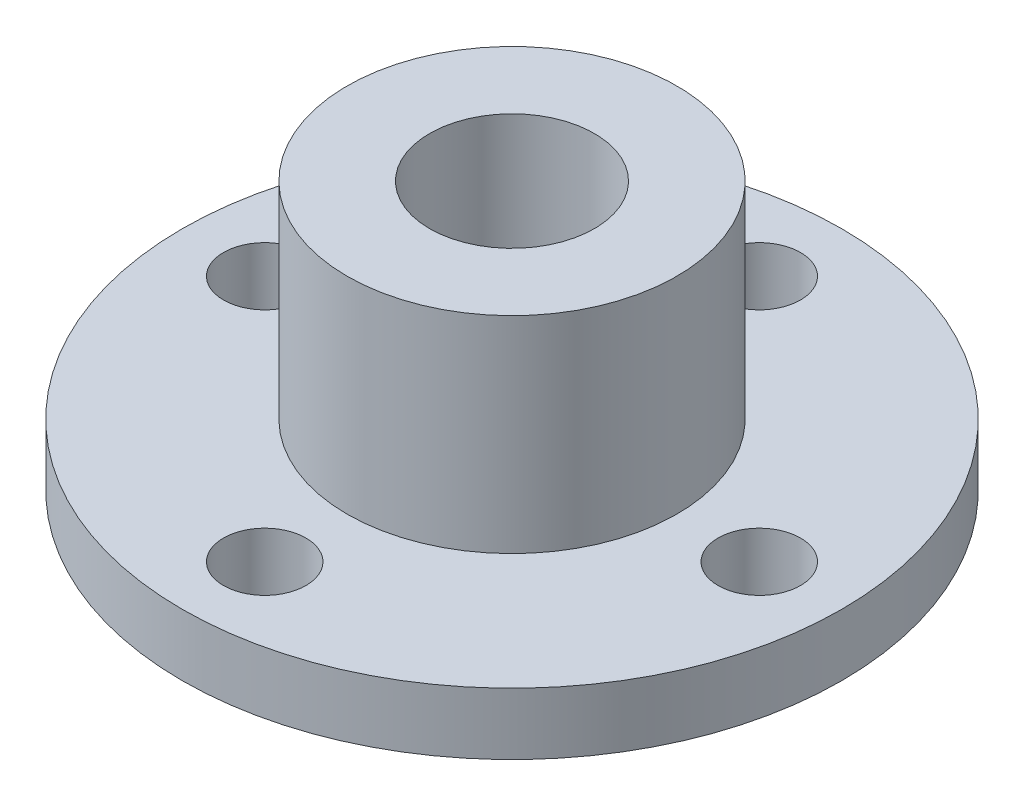
ISO-10303-21;
HEADER;
FILE_DESCRIPTION(('STEP AP214'),'2;1');
FILE_NAME('part.step','',(''),(''),'','','');
FILE_SCHEMA(('AUTOMOTIVE_DESIGN { 1 0 10303 214 1 1 1 1 }'));
ENDSEC;
DATA;
#1=APPLICATION_CONTEXT('core data for automotive mechanical design processes');
#2=APPLICATION_PROTOCOL_DEFINITION('international standard','automotive_design',2000,#1);
#3=PRODUCT_CONTEXT('',#1,'mechanical');
#4=PRODUCT('Part','Part','',(#3));
#5=PRODUCT_RELATED_PRODUCT_CATEGORY('part','',(#4));
#6=PRODUCT_DEFINITION_FORMATION('','',#4);
#7=PRODUCT_DEFINITION_CONTEXT('part definition',#1,'design');
#8=PRODUCT_DEFINITION('design','',#6,#7);
#9=PRODUCT_DEFINITION_SHAPE('','',#8);
#10=(LENGTH_UNIT() NAMED_UNIT(*) SI_UNIT(.MILLI.,.METRE.));
#11=(NAMED_UNIT(*) PLANE_ANGLE_UNIT() SI_UNIT($,.RADIAN.));
#12=(NAMED_UNIT(*) SI_UNIT($,.STERADIAN.) SOLID_ANGLE_UNIT());
#13=UNCERTAINTY_MEASURE_WITH_UNIT(LENGTH_MEASURE(1.E-05),#10,'distance_accuracy_value','');
#14=(GEOMETRIC_REPRESENTATION_CONTEXT(3) GLOBAL_UNCERTAINTY_ASSIGNED_CONTEXT((#13)) GLOBAL_UNIT_ASSIGNED_CONTEXT((#10,
#11,#12)) REPRESENTATION_CONTEXT('',''));
#15=CARTESIAN_POINT('',(0.,0.,0.));
#16=DIRECTION('',(0.,0.,1.));
#17=DIRECTION('',(1.,0.,0.));
#18=AXIS2_PLACEMENT_3D('',#15,#16,#17);
#19=CARTESIAN_POINT('',(0.,3.,-12.));
#20=DIRECTION('',(0.,-1.,0.));
#21=DIRECTION('',(0.,0.,-1.));
#22=AXIS2_PLACEMENT_3D('',#19,#20,#21);
#23=CYLINDRICAL_SURFACE('',#22,2.);
#24=CARTESIAN_POINT('',(0.,3.,-12.));
#25=DIRECTION('',(0.,1.,0.));
#26=DIRECTION('',(0.,0.,1.));
#27=AXIS2_PLACEMENT_3D('',#24,#25,#26);
#28=CIRCLE('',#27,2.);
#29=CARTESIAN_POINT('',(0.,3.,-10.));
#30=VERTEX_POINT('',#29);
#31=EDGE_CURVE('E43',#30,#30,#28,.T.);
#32=ORIENTED_EDGE('',*,*,#31,.T.);
#33=EDGE_LOOP('',(#32));
#34=FACE_BOUND('',#33,.T.);
#35=CARTESIAN_POINT('',(0.,0.,-12.));
#36=DIRECTION('',(0.,1.,0.));
#37=DIRECTION('',(0.,0.,1.));
#38=AXIS2_PLACEMENT_3D('',#35,#36,#37);
#39=CIRCLE('',#38,2.);
#40=CARTESIAN_POINT('',(0.,0.,-10.));
#41=VERTEX_POINT('',#40);
#42=EDGE_CURVE('E50',#41,#41,#39,.T.);
#43=ORIENTED_EDGE('',*,*,#42,.F.);
#44=EDGE_LOOP('',(#43));
#45=FACE_BOUND('',#44,.T.);
#46=ADVANCED_FACE('F31',(#34,#45),#23,.F.);
#47=CARTESIAN_POINT('',(12.,3.,0.));
#48=DIRECTION('',(0.,-1.,0.));
#49=DIRECTION('',(0.,0.,-1.));
#50=AXIS2_PLACEMENT_3D('',#47,#48,#49);
#51=CYLINDRICAL_SURFACE('',#50,2.);
#52=CARTESIAN_POINT('',(12.,3.,0.));
#53=DIRECTION('',(0.,1.,0.));
#54=DIRECTION('',(0.,0.,1.));
#55=AXIS2_PLACEMENT_3D('',#52,#53,#54);
#56=CIRCLE('',#55,2.);
#57=CARTESIAN_POINT('',(12.,3.,2.));
#58=VERTEX_POINT('',#57);
#59=EDGE_CURVE('E62',#58,#58,#56,.T.);
#60=ORIENTED_EDGE('',*,*,#59,.T.);
#61=EDGE_LOOP('',(#60));
#62=FACE_BOUND('',#61,.T.);
#63=CARTESIAN_POINT('',(12.,0.,0.));
#64=DIRECTION('',(0.,1.,0.));
#65=DIRECTION('',(0.,0.,1.));
#66=AXIS2_PLACEMENT_3D('',#63,#64,#65);
#67=CIRCLE('',#66,2.);
#68=CARTESIAN_POINT('',(12.,0.,2.));
#69=VERTEX_POINT('',#68);
#70=EDGE_CURVE('E53',#69,#69,#67,.T.);
#71=ORIENTED_EDGE('',*,*,#70,.F.);
#72=EDGE_LOOP('',(#71));
#73=FACE_BOUND('',#72,.T.);
#74=ADVANCED_FACE('F98',(#62,#73),#51,.F.);
#75=CARTESIAN_POINT('',(0.,3.,0.));
#76=DIRECTION('',(0.,-1.,0.));
#77=DIRECTION('',(0.,0.,-1.));
#78=AXIS2_PLACEMENT_3D('',#75,#76,#77);
#79=CYLINDRICAL_SURFACE('',#78,16.);
#80=CARTESIAN_POINT('',(0.,3.,0.));
#81=DIRECTION('',(0.,1.,0.));
#82=DIRECTION('',(0.,0.,1.));
#83=AXIS2_PLACEMENT_3D('',#80,#81,#82);
#84=CIRCLE('',#83,16.);
#85=CARTESIAN_POINT('',(0.,3.,16.));
#86=VERTEX_POINT('',#85);
#87=EDGE_CURVE('E49',#86,#86,#84,.T.);
#88=ORIENTED_EDGE('',*,*,#87,.F.);
#89=EDGE_LOOP('',(#88));
#90=FACE_BOUND('',#89,.T.);
#91=CARTESIAN_POINT('',(0.,0.,0.));
#92=DIRECTION('',(0.,1.,0.));
#93=DIRECTION('',(0.,0.,1.));
#94=AXIS2_PLACEMENT_3D('',#91,#92,#93);
#95=CIRCLE('',#94,16.);
#96=CARTESIAN_POINT('',(0.,0.,16.));
#97=VERTEX_POINT('',#96);
#98=EDGE_CURVE('E56',#97,#97,#95,.T.);
#99=ORIENTED_EDGE('',*,*,#98,.T.);
#100=EDGE_LOOP('',(#99));
#101=FACE_BOUND('',#100,.T.);
#102=ADVANCED_FACE('F33',(#90,#101),#79,.T.);
#103=CARTESIAN_POINT('',(-12.,3.,0.));
#104=DIRECTION('',(0.,-1.,0.));
#105=DIRECTION('',(0.,0.,-1.));
#106=AXIS2_PLACEMENT_3D('',#103,#104,#105);
#107=CYLINDRICAL_SURFACE('',#106,2.);
#108=CARTESIAN_POINT('',(-12.,3.,0.));
#109=DIRECTION('',(0.,1.,0.));
#110=DIRECTION('',(0.,0.,1.));
#111=AXIS2_PLACEMENT_3D('',#108,#109,#110);
#112=CIRCLE('',#111,2.);
#113=CARTESIAN_POINT('',(-12.,3.,2.));
#114=VERTEX_POINT('',#113);
#115=EDGE_CURVE('E39',#114,#114,#112,.T.);
#116=ORIENTED_EDGE('',*,*,#115,.T.);
#117=EDGE_LOOP('',(#116));
#118=FACE_BOUND('',#117,.T.);
#119=CARTESIAN_POINT('',(-12.,0.,0.));
#120=DIRECTION('',(0.,1.,0.));
#121=DIRECTION('',(0.,0.,1.));
#122=AXIS2_PLACEMENT_3D('',#119,#120,#121);
#123=CIRCLE('',#122,2.);
#124=CARTESIAN_POINT('',(-12.,0.,2.));
#125=VERTEX_POINT('',#124);
#126=EDGE_CURVE('E46',#125,#125,#123,.T.);
#127=ORIENTED_EDGE('',*,*,#126,.F.);
#128=EDGE_LOOP('',(#127));
#129=FACE_BOUND('',#128,.T.);
#130=ADVANCED_FACE('F107',(#118,#129),#107,.F.);
#131=CARTESIAN_POINT('',(0.,3.,0.));
#132=DIRECTION('',(0.,1.,0.));
#133=DIRECTION('',(0.,0.,1.));
#134=AXIS2_PLACEMENT_3D('',#131,#132,#133);
#135=PLANE('',#134);
#136=CARTESIAN_POINT('',(0.,3.,12.));
#137=DIRECTION('',(0.,1.,0.));
#138=DIRECTION('',(0.,0.,1.));
#139=AXIS2_PLACEMENT_3D('',#136,#137,#138);
#140=CIRCLE('',#139,2.);
#141=CARTESIAN_POINT('',(0.,3.,14.));
#142=VERTEX_POINT('',#141);
#143=EDGE_CURVE('E75',#142,#142,#140,.T.);
#144=ORIENTED_EDGE('',*,*,#143,.F.);
#145=EDGE_LOOP('',(#144));
#146=FACE_BOUND('',#145,.T.);
#147=CARTESIAN_POINT('',(0.,3.,0.));
#148=DIRECTION('',(0.,1.,0.));
#149=DIRECTION('',(0.,0.,1.));
#150=AXIS2_PLACEMENT_3D('',#147,#148,#149);
#151=CIRCLE('',#150,8.);
#152=CARTESIAN_POINT('',(0.,3.,8.));
#153=VERTEX_POINT('',#152);
#154=EDGE_CURVE('E67',#153,#153,#151,.T.);
#155=ORIENTED_EDGE('',*,*,#154,.F.);
#156=EDGE_LOOP('',(#155));
#157=FACE_BOUND('',#156,.T.);
#158=ORIENTED_EDGE('',*,*,#87,.T.);
#159=EDGE_LOOP('',(#158));
#160=FACE_BOUND('',#159,.T.);
#161=ORIENTED_EDGE('',*,*,#59,.F.);
#162=EDGE_LOOP('',(#161));
#163=FACE_BOUND('',#162,.T.);
#164=ORIENTED_EDGE('',*,*,#31,.F.);
#165=EDGE_LOOP('',(#164));
#166=FACE_BOUND('',#165,.T.);
#167=ORIENTED_EDGE('',*,*,#115,.F.);
#168=EDGE_LOOP('',(#167));
#169=FACE_BOUND('',#168,.T.);
#170=ADVANCED_FACE('F95',(#146,#157,#160,#163,#166,#169),#135,.T.);
#171=CARTESIAN_POINT('',(0.,0.,0.));
#172=DIRECTION('',(0.,1.,0.));
#173=DIRECTION('',(0.,0.,1.));
#174=AXIS2_PLACEMENT_3D('',#171,#172,#173);
#175=PLANE('',#174);
#176=CARTESIAN_POINT('',(0.,0.,12.));
#177=DIRECTION('',(0.,1.,0.));
#178=DIRECTION('',(0.,0.,1.));
#179=AXIS2_PLACEMENT_3D('',#176,#177,#178);
#180=CIRCLE('',#179,2.);
#181=CARTESIAN_POINT('',(0.,0.,14.));
#182=VERTEX_POINT('',#181);
#183=EDGE_CURVE('E35',#182,#182,#180,.T.);
#184=ORIENTED_EDGE('',*,*,#183,.T.);
#185=EDGE_LOOP('',(#184));
#186=FACE_BOUND('',#185,.T.);
#187=ORIENTED_EDGE('',*,*,#98,.F.);
#188=EDGE_LOOP('',(#187));
#189=FACE_BOUND('',#188,.T.);
#190=ORIENTED_EDGE('',*,*,#70,.T.);
#191=EDGE_LOOP('',(#190));
#192=FACE_BOUND('',#191,.T.);
#193=ORIENTED_EDGE('',*,*,#42,.T.);
#194=EDGE_LOOP('',(#193));
#195=FACE_BOUND('',#194,.T.);
#196=ORIENTED_EDGE('',*,*,#126,.T.);
#197=EDGE_LOOP('',(#196));
#198=FACE_BOUND('',#197,.T.);
#199=ADVANCED_FACE('F82',(#186,#189,#192,#195,#198),#175,.F.);
#200=CARTESIAN_POINT('',(0.,13.,0.));
#201=DIRECTION('',(0.,1.,0.));
#202=DIRECTION('',(0.,0.,1.));
#203=AXIS2_PLACEMENT_3D('',#200,#201,#202);
#204=PLANE('',#203);
#205=CARTESIAN_POINT('',(0.,13.,0.));
#206=DIRECTION('',(0.,1.,0.));
#207=DIRECTION('',(0.,0.,1.));
#208=AXIS2_PLACEMENT_3D('',#205,#206,#207);
#209=CIRCLE('',#208,8.);
#210=CARTESIAN_POINT('',(0.,13.,8.));
#211=VERTEX_POINT('',#210);
#212=EDGE_CURVE('E58',#211,#211,#209,.T.);
#213=ORIENTED_EDGE('',*,*,#212,.T.);
#214=EDGE_LOOP('',(#213));
#215=FACE_BOUND('',#214,.T.);
#216=CARTESIAN_POINT('',(0.,13.,0.));
#217=DIRECTION('',(0.,1.,0.));
#218=DIRECTION('',(0.,0.,1.));
#219=AXIS2_PLACEMENT_3D('',#216,#217,#218);
#220=CIRCLE('',#219,4.);
#221=CARTESIAN_POINT('',(0.,13.,4.));
#222=VERTEX_POINT('',#221);
#223=EDGE_CURVE('E70',#222,#222,#220,.T.);
#224=ORIENTED_EDGE('',*,*,#223,.F.);
#225=EDGE_LOOP('',(#224));
#226=FACE_BOUND('',#225,.T.);
#227=ADVANCED_FACE('F112',(#215,#226),#204,.T.);
#228=CARTESIAN_POINT('',(0.,13.,0.));
#229=DIRECTION('',(0.,-1.,0.));
#230=DIRECTION('',(0.,0.,-1.));
#231=AXIS2_PLACEMENT_3D('',#228,#229,#230);
#232=CYLINDRICAL_SURFACE('',#231,8.);
#233=ORIENTED_EDGE('',*,*,#212,.F.);
#234=EDGE_LOOP('',(#233));
#235=FACE_BOUND('',#234,.T.);
#236=ORIENTED_EDGE('',*,*,#154,.T.);
#237=EDGE_LOOP('',(#236));
#238=FACE_BOUND('',#237,.T.);
#239=ADVANCED_FACE('F116',(#235,#238),#232,.T.);
#240=CARTESIAN_POINT('',(0.,13.,0.));
#241=DIRECTION('',(0.,-1.,0.));
#242=DIRECTION('',(0.,0.,-1.));
#243=AXIS2_PLACEMENT_3D('',#240,#241,#242);
#244=CYLINDRICAL_SURFACE('',#243,4.);
#245=ORIENTED_EDGE('',*,*,#223,.T.);
#246=EDGE_LOOP('',(#245));
#247=FACE_BOUND('',#246,.T.);
#248=CARTESIAN_POINT('',(0.,3.,0.));
#249=DIRECTION('',(0.,1.,0.));
#250=DIRECTION('',(0.,0.,1.));
#251=AXIS2_PLACEMENT_3D('',#248,#249,#250);
#252=CIRCLE('',#251,4.);
#253=CARTESIAN_POINT('',(0.,3.,4.));
#254=VERTEX_POINT('',#253);
#255=EDGE_CURVE('E10',#254,#254,#252,.F.);
#256=ORIENTED_EDGE('',*,*,#255,.T.);
#257=EDGE_LOOP('',(#256));
#258=FACE_BOUND('',#257,.T.);
#259=ADVANCED_FACE('F92',(#247,#258),#244,.F.);
#260=ORIENTED_EDGE('',*,*,#255,.F.);
#261=EDGE_LOOP('',(#260));
#262=FACE_BOUND('',#261,.T.);
#263=ADVANCED_FACE('F87',(#262),#135,.T.);
#264=CARTESIAN_POINT('',(0.,-7.,12.));
#265=DIRECTION('',(0.,1.,0.));
#266=DIRECTION('',(0.,0.,1.));
#267=AXIS2_PLACEMENT_3D('',#264,#265,#266);
#268=CYLINDRICAL_SURFACE('',#267,2.);
#269=ORIENTED_EDGE('',*,*,#143,.T.);
#270=EDGE_LOOP('',(#269));
#271=FACE_BOUND('',#270,.T.);
#272=ORIENTED_EDGE('',*,*,#183,.F.);
#273=EDGE_LOOP('',(#272));
#274=FACE_BOUND('',#273,.T.);
#275=ADVANCED_FACE('F85',(#271,#274),#268,.F.);
#276=CLOSED_SHELL('',(#46,#74,#102,#130,#170,#199,#227,#239,#259,#263,#275));
#277=MANIFOLD_SOLID_BREP('B2',#276);
#278=ADVANCED_BREP_SHAPE_REPRESENTATION('',(#18,#277),#14);
#279=SHAPE_DEFINITION_REPRESENTATION(#9,#278);
ENDSEC;
END-ISO-10303-21;
